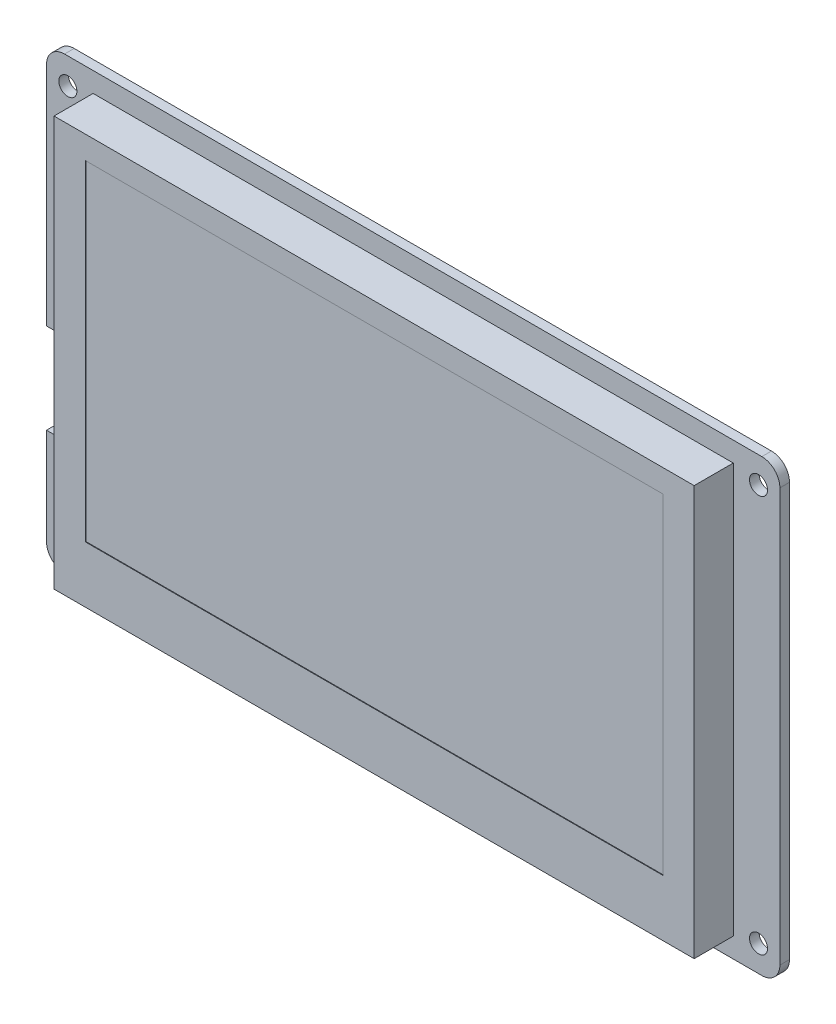
ISO-10303-21;
HEADER;
FILE_DESCRIPTION(('STEP AP214'),'2;1');
FILE_NAME('part.step','',(''),(''),'','','');
FILE_SCHEMA(('AUTOMOTIVE_DESIGN { 1 0 10303 214 1 1 1 1 }'));
ENDSEC;
DATA;
#1=APPLICATION_CONTEXT('core data for automotive mechanical design processes');
#2=APPLICATION_PROTOCOL_DEFINITION('international standard','automotive_design',2000,#1);
#3=PRODUCT_CONTEXT('',#1,'mechanical');
#4=PRODUCT('Part','Part','',(#3));
#5=PRODUCT_RELATED_PRODUCT_CATEGORY('part','',(#4));
#6=PRODUCT_DEFINITION_FORMATION('','',#4);
#7=PRODUCT_DEFINITION_CONTEXT('part definition',#1,'design');
#8=PRODUCT_DEFINITION('design','',#6,#7);
#9=PRODUCT_DEFINITION_SHAPE('','',#8);
#10=(LENGTH_UNIT() NAMED_UNIT(*) SI_UNIT(.MILLI.,.METRE.));
#11=(NAMED_UNIT(*) PLANE_ANGLE_UNIT() SI_UNIT($,.RADIAN.));
#12=(NAMED_UNIT(*) SI_UNIT($,.STERADIAN.) SOLID_ANGLE_UNIT());
#13=UNCERTAINTY_MEASURE_WITH_UNIT(LENGTH_MEASURE(1.E-05),#10,'distance_accuracy_value','');
#14=(GEOMETRIC_REPRESENTATION_CONTEXT(3) GLOBAL_UNCERTAINTY_ASSIGNED_CONTEXT((#13)) GLOBAL_UNIT_ASSIGNED_CONTEXT((#10,
#11,#12)) REPRESENTATION_CONTEXT('',''));
#15=CARTESIAN_POINT('',(0.,0.,0.));
#16=DIRECTION('',(0.,0.,1.));
#17=DIRECTION('',(1.,0.,0.));
#18=AXIS2_PLACEMENT_3D('',#15,#16,#17);
#19=CARTESIAN_POINT('',(0.,0.,0.));
#20=DIRECTION('',(0.,0.,-1.));
#21=DIRECTION('',(-1.,0.,0.));
#22=AXIS2_PLACEMENT_3D('',#19,#20,#21);
#23=PLANE('',#22);
#24=CARTESIAN_POINT('',(-57.4,33.,0.));
#25=DIRECTION('',(0.,0.,1.));
#26=DIRECTION('',(1.,0.,0.));
#27=AXIS2_PLACEMENT_3D('',#24,#25,#26);
#28=CIRCLE('',#27,1.5);
#29=CARTESIAN_POINT('',(-55.9,33.,0.));
#30=VERTEX_POINT('',#29);
#31=EDGE_CURVE('E296',#30,#30,#28,.T.);
#32=ORIENTED_EDGE('',*,*,#31,.T.);
#33=EDGE_LOOP('',(#32));
#34=FACE_BOUND('',#33,.T.);
#35=CARTESIAN_POINT('',(-57.4,-33.,0.));
#36=DIRECTION('',(0.,0.,1.));
#37=DIRECTION('',(1.,0.,0.));
#38=AXIS2_PLACEMENT_3D('',#35,#36,#37);
#39=CIRCLE('',#38,1.5);
#40=CARTESIAN_POINT('',(-55.9,-33.,0.));
#41=VERTEX_POINT('',#40);
#42=EDGE_CURVE('E290',#41,#41,#39,.T.);
#43=ORIENTED_EDGE('',*,*,#42,.T.);
#44=EDGE_LOOP('',(#43));
#45=FACE_BOUND('',#44,.T.);
#46=CARTESIAN_POINT('',(57.4,-33.,0.));
#47=DIRECTION('',(0.,0.,1.));
#48=DIRECTION('',(1.,0.,0.));
#49=AXIS2_PLACEMENT_3D('',#46,#47,#48);
#50=CIRCLE('',#49,1.5);
#51=CARTESIAN_POINT('',(58.9,-33.,0.));
#52=VERTEX_POINT('',#51);
#53=EDGE_CURVE('E284',#52,#52,#50,.T.);
#54=ORIENTED_EDGE('',*,*,#53,.T.);
#55=EDGE_LOOP('',(#54));
#56=FACE_BOUND('',#55,.T.);
#57=CARTESIAN_POINT('',(57.4,33.,0.));
#58=DIRECTION('',(0.,0.,1.));
#59=DIRECTION('',(1.,0.,0.));
#60=AXIS2_PLACEMENT_3D('',#57,#58,#59);
#61=CIRCLE('',#60,1.5);
#62=CARTESIAN_POINT('',(58.9,33.,0.));
#63=VERTEX_POINT('',#62);
#64=EDGE_CURVE('E278',#63,#63,#61,.T.);
#65=ORIENTED_EDGE('',*,*,#64,.T.);
#66=EDGE_LOOP('',(#65));
#67=FACE_BOUND('',#66,.T.);
#68=DIRECTION('',(-1.,0.,0.));
#69=VECTOR('',#68,1.);
#70=CARTESIAN_POINT('',(-56.75,-18.3,0.));
#71=LINE('',#70,#69);
#72=CARTESIAN_POINT('',(-56.75,-18.3,0.));
#73=VERTEX_POINT('',#72);
#74=CARTESIAN_POINT('',(-60.95,-18.3,0.));
#75=VERTEX_POINT('',#74);
#76=EDGE_CURVE('E187',#73,#75,#71,.T.);
#77=ORIENTED_EDGE('',*,*,#76,.F.);
#78=DIRECTION('',(0.,-1.,0.));
#79=VECTOR('',#78,1.);
#80=CARTESIAN_POINT('',(-56.75,-18.3,0.));
#81=LINE('',#80,#79);
#82=CARTESIAN_POINT('',(-56.75,-3.29999999999997,0.));
#83=VERTEX_POINT('',#82);
#84=EDGE_CURVE('E181',#83,#73,#81,.T.);
#85=ORIENTED_EDGE('',*,*,#84,.F.);
#86=DIRECTION('',(1.,0.,0.));
#87=VECTOR('',#86,1.);
#88=CARTESIAN_POINT('',(0.,-3.29999999999997,0.));
#89=LINE('',#88,#87);
#90=CARTESIAN_POINT('',(-60.95,-3.29999999999997,0.));
#91=VERTEX_POINT('',#90);
#92=EDGE_CURVE('E11',#91,#83,#89,.T.);
#93=ORIENTED_EDGE('',*,*,#92,.F.);
#94=DIRECTION('',(0.,-1.,0.));
#95=VECTOR('',#94,1.);
#96=CARTESIAN_POINT('',(-60.95,-37.35,0.));
#97=LINE('',#96,#95);
#98=CARTESIAN_POINT('',(-60.95,34.35,0.));
#99=VERTEX_POINT('',#98);
#100=EDGE_CURVE('E323',#99,#91,#97,.T.);
#101=ORIENTED_EDGE('',*,*,#100,.F.);
#102=CARTESIAN_POINT('',(-57.95,34.35,0.));
#103=DIRECTION('',(0.,0.,-1.));
#104=DIRECTION('',(-1.,0.,0.));
#105=AXIS2_PLACEMENT_3D('',#102,#103,#104);
#106=CIRCLE('',#105,3.);
#107=CARTESIAN_POINT('',(-57.95,37.35,0.));
#108=VERTEX_POINT('',#107);
#109=EDGE_CURVE('E339',#99,#108,#106,.T.);
#110=ORIENTED_EDGE('',*,*,#109,.T.);
#111=DIRECTION('',(-1.,0.,0.));
#112=VECTOR('',#111,1.);
#113=CARTESIAN_POINT('',(-60.95,37.35,0.));
#114=LINE('',#113,#112);
#115=CARTESIAN_POINT('',(57.95,37.35,0.));
#116=VERTEX_POINT('',#115);
#117=EDGE_CURVE('E319',#116,#108,#114,.T.);
#118=ORIENTED_EDGE('',*,*,#117,.F.);
#119=CARTESIAN_POINT('',(57.95,34.35,0.));
#120=DIRECTION('',(0.,0.,-1.));
#121=DIRECTION('',(-1.,0.,0.));
#122=AXIS2_PLACEMENT_3D('',#119,#120,#121);
#123=CIRCLE('',#122,3.);
#124=CARTESIAN_POINT('',(60.95,34.35,0.));
#125=VERTEX_POINT('',#124);
#126=EDGE_CURVE('E332',#116,#125,#123,.T.);
#127=ORIENTED_EDGE('',*,*,#126,.T.);
#128=DIRECTION('',(0.,1.,0.));
#129=VECTOR('',#128,1.);
#130=CARTESIAN_POINT('',(60.95,-37.35,0.));
#131=LINE('',#130,#129);
#132=CARTESIAN_POINT('',(60.95,-34.35,0.));
#133=VERTEX_POINT('',#132);
#134=EDGE_CURVE('E299',#133,#125,#131,.T.);
#135=ORIENTED_EDGE('',*,*,#134,.F.);
#136=CARTESIAN_POINT('',(57.95,-34.35,0.));
#137=DIRECTION('',(0.,0.,-1.));
#138=DIRECTION('',(-1.,0.,0.));
#139=AXIS2_PLACEMENT_3D('',#136,#137,#138);
#140=CIRCLE('',#139,3.);
#141=CARTESIAN_POINT('',(57.95,-37.35,0.));
#142=VERTEX_POINT('',#141);
#143=EDGE_CURVE('E334',#133,#142,#140,.T.);
#144=ORIENTED_EDGE('',*,*,#143,.T.);
#145=DIRECTION('',(1.,0.,0.));
#146=VECTOR('',#145,1.);
#147=CARTESIAN_POINT('',(-60.95,-37.35,0.));
#148=LINE('',#147,#146);
#149=CARTESIAN_POINT('',(-57.95,-37.35,0.));
#150=VERTEX_POINT('',#149);
#151=EDGE_CURVE('E306',#150,#142,#148,.T.);
#152=ORIENTED_EDGE('',*,*,#151,.F.);
#153=CARTESIAN_POINT('',(-57.95,-34.35,0.));
#154=DIRECTION('',(0.,0.,-1.));
#155=DIRECTION('',(-1.,0.,0.));
#156=AXIS2_PLACEMENT_3D('',#153,#154,#155);
#157=CIRCLE('',#156,3.);
#158=CARTESIAN_POINT('',(-60.95,-34.35,0.));
#159=VERTEX_POINT('',#158);
#160=EDGE_CURVE('E336',#150,#159,#157,.T.);
#161=ORIENTED_EDGE('',*,*,#160,.T.);
#162=EDGE_CURVE('E322',#75,#159,#97,.T.);
#163=ORIENTED_EDGE('',*,*,#162,.F.);
#164=EDGE_LOOP('',(#77,#85,#93,#101,#110,#118,#127,#135,#144,#152,#161,#163));
#165=FACE_BOUND('',#164,.T.);
#166=CARTESIAN_POINT('',(-40.95,25.35,1.11022302462516E-13));
#167=DIRECTION('',(0.,0.,-1.));
#168=DIRECTION('',(-1.,0.,0.));
#169=AXIS2_PLACEMENT_3D('',#166,#167,#168);
#170=CIRCLE('',#169,5.);
#171=CARTESIAN_POINT('',(-45.95,25.35,1.11022302462516E-13));
#172=VERTEX_POINT('',#171);
#173=EDGE_CURVE('E199',#172,#172,#170,.T.);
#174=ORIENTED_EDGE('',*,*,#173,.F.);
#175=EDGE_LOOP('',(#174));
#176=FACE_BOUND('',#175,.T.);
#177=ADVANCED_FACE('F40',(#34,#45,#56,#67,#165,#176),#23,.T.);
#178=CARTESIAN_POINT('',(-60.95,-37.3500000000001,1.60000000000005));
#179=DIRECTION('',(1.,0.,0.));
#180=DIRECTION('',(0.,0.,-1.));
#181=AXIS2_PLACEMENT_3D('',#178,#179,#180);
#182=PLANE('',#181);
#183=DIRECTION('',(0.,-1.,0.));
#184=VECTOR('',#183,1.);
#185=CARTESIAN_POINT('',(-60.95,-37.3500000000001,1.60000000000005));
#186=LINE('',#185,#184);
#187=CARTESIAN_POINT('',(-60.95,-18.3,1.60000000000005));
#188=VERTEX_POINT('',#187);
#189=CARTESIAN_POINT('',(-60.95,-34.35,1.60000000000005));
#190=VERTEX_POINT('',#189);
#191=EDGE_CURVE('E309',#188,#190,#186,.T.);
#192=ORIENTED_EDGE('',*,*,#191,.F.);
#193=DIRECTION('',(0.,0.,-1.));
#194=VECTOR('',#193,1.);
#195=CARTESIAN_POINT('',(-60.95,-18.3,1.60000000000005));
#196=LINE('',#195,#194);
#197=EDGE_CURVE('E208',#188,#75,#196,.T.);
#198=ORIENTED_EDGE('',*,*,#197,.T.);
#199=ORIENTED_EDGE('',*,*,#162,.T.);
#200=DIRECTION('',(0.,0.,-1.));
#201=VECTOR('',#200,1.);
#202=CARTESIAN_POINT('',(-60.95,-34.35,1.60000000000005));
#203=LINE('',#202,#201);
#204=EDGE_CURVE('E316',#159,#190,#203,.F.);
#205=ORIENTED_EDGE('',*,*,#204,.T.);
#206=EDGE_LOOP('',(#192,#198,#199,#205));
#207=FACE_BOUND('',#206,.T.);
#208=ADVANCED_FACE('F391',(#207),#182,.F.);
#209=CARTESIAN_POINT('',(0.,0.,1.60000000000005));
#210=DIRECTION('',(0.,0.,-1.));
#211=DIRECTION('',(-1.,0.,0.));
#212=AXIS2_PLACEMENT_3D('',#209,#210,#211);
#213=PLANE('',#212);
#214=DIRECTION('',(0.,-1.,0.));
#215=VECTOR('',#214,1.);
#216=CARTESIAN_POINT('',(-56.75,0.,1.60000000000005));
#217=LINE('',#216,#215);
#218=CARTESIAN_POINT('',(-56.75,-3.29999999999997,1.60000000000005));
#219=VERTEX_POINT('',#218);
#220=CARTESIAN_POINT('',(-56.75,-18.3,1.60000000000005));
#221=VERTEX_POINT('',#220);
#222=EDGE_CURVE('E184',#219,#221,#217,.T.);
#223=ORIENTED_EDGE('',*,*,#222,.T.);
#224=DIRECTION('',(-1.,0.,0.));
#225=VECTOR('',#224,1.);
#226=CARTESIAN_POINT('',(0.,-18.3,1.60000000000005));
#227=LINE('',#226,#225);
#228=EDGE_CURVE('E211',#221,#188,#227,.T.);
#229=ORIENTED_EDGE('',*,*,#228,.T.);
#230=ORIENTED_EDGE('',*,*,#191,.T.);
#231=CARTESIAN_POINT('',(-57.95,-34.35,1.60000000000005));
#232=DIRECTION('',(0.,0.,-1.));
#233=DIRECTION('',(-1.,0.,0.));
#234=AXIS2_PLACEMENT_3D('',#231,#232,#233);
#235=CIRCLE('',#234,3.);
#236=CARTESIAN_POINT('',(-57.95,-37.3500000000001,1.60000000000005));
#237=VERTEX_POINT('',#236);
#238=EDGE_CURVE('E350',#190,#237,#235,.F.);
#239=ORIENTED_EDGE('',*,*,#238,.T.);
#240=DIRECTION('',(1.,0.,0.));
#241=VECTOR('',#240,1.);
#242=CARTESIAN_POINT('',(-60.95,-37.3500000000001,1.60000000000005));
#243=LINE('',#242,#241);
#244=CARTESIAN_POINT('',(57.95,-37.3500000000001,1.60000000000005));
#245=VERTEX_POINT('',#244);
#246=EDGE_CURVE('E313',#237,#245,#243,.T.);
#247=ORIENTED_EDGE('',*,*,#246,.T.);
#248=CARTESIAN_POINT('',(57.95,-34.35,1.60000000000005));
#249=DIRECTION('',(0.,0.,-1.));
#250=DIRECTION('',(-1.,0.,0.));
#251=AXIS2_PLACEMENT_3D('',#248,#249,#250);
#252=CIRCLE('',#251,3.);
#253=CARTESIAN_POINT('',(60.95,-34.35,1.60000000000005));
#254=VERTEX_POINT('',#253);
#255=EDGE_CURVE('E348',#245,#254,#252,.F.);
#256=ORIENTED_EDGE('',*,*,#255,.T.);
#257=DIRECTION('',(0.,1.,0.));
#258=VECTOR('',#257,1.);
#259=CARTESIAN_POINT('',(60.95,-37.3500000000001,1.60000000000005));
#260=LINE('',#259,#258);
#261=CARTESIAN_POINT('',(60.95,34.35,1.60000000000005));
#262=VERTEX_POINT('',#261);
#263=EDGE_CURVE('E302',#254,#262,#260,.T.);
#264=ORIENTED_EDGE('',*,*,#263,.T.);
#265=CARTESIAN_POINT('',(57.95,34.35,1.60000000000005));
#266=DIRECTION('',(0.,0.,-1.));
#267=DIRECTION('',(-1.,0.,0.));
#268=AXIS2_PLACEMENT_3D('',#265,#266,#267);
#269=CIRCLE('',#268,3.);
#270=CARTESIAN_POINT('',(57.95,37.35,1.60000000000005));
#271=VERTEX_POINT('',#270);
#272=EDGE_CURVE('E346',#262,#271,#269,.F.);
#273=ORIENTED_EDGE('',*,*,#272,.T.);
#274=DIRECTION('',(-1.,0.,0.));
#275=VECTOR('',#274,1.);
#276=CARTESIAN_POINT('',(-60.95,37.35,1.60000000000005));
#277=LINE('',#276,#275);
#278=CARTESIAN_POINT('',(-57.95,37.35,1.60000000000005));
#279=VERTEX_POINT('',#278);
#280=EDGE_CURVE('E305',#271,#279,#277,.T.);
#281=ORIENTED_EDGE('',*,*,#280,.T.);
#282=CARTESIAN_POINT('',(-57.95,34.35,1.60000000000005));
#283=DIRECTION('',(0.,0.,-1.));
#284=DIRECTION('',(-1.,0.,0.));
#285=AXIS2_PLACEMENT_3D('',#282,#283,#284);
#286=CIRCLE('',#285,3.);
#287=CARTESIAN_POINT('',(-60.95,34.35,1.60000000000005));
#288=VERTEX_POINT('',#287);
#289=EDGE_CURVE('E352',#279,#288,#286,.F.);
#290=ORIENTED_EDGE('',*,*,#289,.T.);
#291=CARTESIAN_POINT('',(-60.95,-3.29999999999997,1.60000000000005));
#292=VERTEX_POINT('',#291);
#293=EDGE_CURVE('E310',#288,#292,#186,.T.);
#294=ORIENTED_EDGE('',*,*,#293,.T.);
#295=DIRECTION('',(1.,0.,0.));
#296=VECTOR('',#295,1.);
#297=CARTESIAN_POINT('',(0.,-3.29999999999997,1.60000000000005));
#298=LINE('',#297,#296);
#299=EDGE_CURVE('E205',#292,#219,#298,.T.);
#300=ORIENTED_EDGE('',*,*,#299,.T.);
#301=EDGE_LOOP('',(#223,#229,#230,#239,#247,#256,#264,#273,#281,#290,#294,#300));
#302=FACE_BOUND('',#301,.T.);
#303=CARTESIAN_POINT('',(-57.4,33.,1.60000000000005));
#304=DIRECTION('',(0.,0.,1.));
#305=DIRECTION('',(1.,0.,0.));
#306=AXIS2_PLACEMENT_3D('',#303,#304,#305);
#307=CIRCLE('',#306,1.5);
#308=CARTESIAN_POINT('',(-55.9,33.,1.60000000000005));
#309=VERTEX_POINT('',#308);
#310=EDGE_CURVE('E293',#309,#309,#307,.T.);
#311=ORIENTED_EDGE('',*,*,#310,.F.);
#312=EDGE_LOOP('',(#311));
#313=FACE_BOUND('',#312,.T.);
#314=CARTESIAN_POINT('',(-57.4,-33.,1.6000000000001));
#315=DIRECTION('',(0.,0.,1.));
#316=DIRECTION('',(1.,0.,0.));
#317=AXIS2_PLACEMENT_3D('',#314,#315,#316);
#318=CIRCLE('',#317,1.5);
#319=CARTESIAN_POINT('',(-55.9,-33.,1.6000000000001));
#320=VERTEX_POINT('',#319);
#321=EDGE_CURVE('E287',#320,#320,#318,.T.);
#322=ORIENTED_EDGE('',*,*,#321,.F.);
#323=EDGE_LOOP('',(#322));
#324=FACE_BOUND('',#323,.T.);
#325=CARTESIAN_POINT('',(57.4,-33.,1.6000000000001));
#326=DIRECTION('',(0.,0.,1.));
#327=DIRECTION('',(1.,0.,0.));
#328=AXIS2_PLACEMENT_3D('',#325,#326,#327);
#329=CIRCLE('',#328,1.5);
#330=CARTESIAN_POINT('',(58.9,-33.,1.6000000000001));
#331=VERTEX_POINT('',#330);
#332=EDGE_CURVE('E281',#331,#331,#329,.T.);
#333=ORIENTED_EDGE('',*,*,#332,.F.);
#334=EDGE_LOOP('',(#333));
#335=FACE_BOUND('',#334,.T.);
#336=CARTESIAN_POINT('',(57.4,33.,1.60000000000005));
#337=DIRECTION('',(0.,0.,1.));
#338=DIRECTION('',(1.,0.,0.));
#339=AXIS2_PLACEMENT_3D('',#336,#337,#338);
#340=CIRCLE('',#339,1.5);
#341=CARTESIAN_POINT('',(58.9,33.,1.60000000000005));
#342=VERTEX_POINT('',#341);
#343=EDGE_CURVE('E277',#342,#342,#340,.T.);
#344=ORIENTED_EDGE('',*,*,#343,.F.);
#345=EDGE_LOOP('',(#344));
#346=FACE_BOUND('',#345,.T.);
#347=DIRECTION('',(0.,1.,0.));
#348=VECTOR('',#347,1.);
#349=CARTESIAN_POINT('',(53.2,-34.05,1.59999999999999));
#350=LINE('',#349,#348);
#351=CARTESIAN_POINT('',(53.2,-34.05,1.59999999999999));
#352=VERTEX_POINT('',#351);
#353=CARTESIAN_POINT('',(53.2,34.05,1.60000000000005));
#354=VERTEX_POINT('',#353);
#355=EDGE_CURVE('E239',#352,#354,#350,.T.);
#356=ORIENTED_EDGE('',*,*,#355,.F.);
#357=DIRECTION('',(1.,0.,0.));
#358=VECTOR('',#357,1.);
#359=CARTESIAN_POINT('',(-53.2,-34.05,1.59999999999999));
#360=LINE('',#359,#358);
#361=CARTESIAN_POINT('',(-53.2,-34.05,1.59999999999999));
#362=VERTEX_POINT('',#361);
#363=EDGE_CURVE('E249',#362,#352,#360,.T.);
#364=ORIENTED_EDGE('',*,*,#363,.F.);
#365=DIRECTION('',(0.,-1.,0.));
#366=VECTOR('',#365,1.);
#367=CARTESIAN_POINT('',(-53.2,-34.05,1.59999999999999));
#368=LINE('',#367,#366);
#369=CARTESIAN_POINT('',(-53.2,34.05,1.60000000000005));
#370=VERTEX_POINT('',#369);
#371=EDGE_CURVE('E261',#370,#362,#368,.T.);
#372=ORIENTED_EDGE('',*,*,#371,.F.);
#373=DIRECTION('',(-1.,0.,0.));
#374=VECTOR('',#373,1.);
#375=CARTESIAN_POINT('',(-53.2,34.05,1.60000000000005));
#376=LINE('',#375,#374);
#377=EDGE_CURVE('E258',#354,#370,#376,.T.);
#378=ORIENTED_EDGE('',*,*,#377,.F.);
#379=EDGE_LOOP('',(#356,#364,#372,#378));
#380=FACE_BOUND('',#379,.T.);
#381=ADVANCED_FACE('F380',(#302,#313,#324,#335,#346,#380),#213,.F.);
#382=CARTESIAN_POINT('',(60.95,-37.3500000000001,1.60000000000005));
#383=DIRECTION('',(-1.,0.,0.));
#384=DIRECTION('',(0.,0.,1.));
#385=AXIS2_PLACEMENT_3D('',#382,#383,#384);
#386=PLANE('',#385);
#387=ORIENTED_EDGE('',*,*,#263,.F.);
#388=DIRECTION('',(0.,0.,-1.));
#389=VECTOR('',#388,1.);
#390=CARTESIAN_POINT('',(60.95,-34.35,1.60000000000005));
#391=LINE('',#390,#389);
#392=EDGE_CURVE('E48',#254,#133,#391,.T.);
#393=ORIENTED_EDGE('',*,*,#392,.T.);
#394=ORIENTED_EDGE('',*,*,#134,.T.);
#395=DIRECTION('',(0.,0.,-1.));
#396=VECTOR('',#395,1.);
#397=CARTESIAN_POINT('',(60.95,34.35,1.60000000000005));
#398=LINE('',#397,#396);
#399=EDGE_CURVE('E359',#125,#262,#398,.F.);
#400=ORIENTED_EDGE('',*,*,#399,.T.);
#401=EDGE_LOOP('',(#387,#393,#394,#400));
#402=FACE_BOUND('',#401,.T.);
#403=ADVANCED_FACE('F365',(#402),#386,.F.);
#404=CARTESIAN_POINT('',(-60.95,37.35,1.60000000000005));
#405=DIRECTION('',(0.,-1.,0.));
#406=DIRECTION('',(0.,0.,-1.));
#407=AXIS2_PLACEMENT_3D('',#404,#405,#406);
#408=PLANE('',#407);
#409=ORIENTED_EDGE('',*,*,#117,.T.);
#410=DIRECTION('',(0.,0.,-1.));
#411=VECTOR('',#410,1.);
#412=CARTESIAN_POINT('',(-57.95,37.35,1.60000000000005));
#413=LINE('',#412,#411);
#414=EDGE_CURVE('E344',#108,#279,#413,.F.);
#415=ORIENTED_EDGE('',*,*,#414,.T.);
#416=ORIENTED_EDGE('',*,*,#280,.F.);
#417=DIRECTION('',(0.,0.,-1.));
#418=VECTOR('',#417,1.);
#419=CARTESIAN_POINT('',(57.95,37.35,1.60000000000005));
#420=LINE('',#419,#418);
#421=EDGE_CURVE('E341',#271,#116,#420,.T.);
#422=ORIENTED_EDGE('',*,*,#421,.T.);
#423=EDGE_LOOP('',(#409,#415,#416,#422));
#424=FACE_BOUND('',#423,.T.);
#425=ADVANCED_FACE('F376',(#424),#408,.F.);
#426=ORIENTED_EDGE('',*,*,#100,.T.);
#427=DIRECTION('',(0.,0.,1.));
#428=VECTOR('',#427,1.);
#429=CARTESIAN_POINT('',(-60.95,-3.29999999999997,1.60000000000005));
#430=LINE('',#429,#428);
#431=EDGE_CURVE('E54',#91,#292,#430,.T.);
#432=ORIENTED_EDGE('',*,*,#431,.T.);
#433=ORIENTED_EDGE('',*,*,#293,.F.);
#434=DIRECTION('',(0.,0.,-1.));
#435=VECTOR('',#434,1.);
#436=CARTESIAN_POINT('',(-60.95,34.35,1.60000000000005));
#437=LINE('',#436,#435);
#438=EDGE_CURVE('E329',#288,#99,#437,.T.);
#439=ORIENTED_EDGE('',*,*,#438,.T.);
#440=EDGE_LOOP('',(#426,#432,#433,#439));
#441=FACE_BOUND('',#440,.T.);
#442=ADVANCED_FACE('F387',(#441),#182,.F.);
#443=CARTESIAN_POINT('',(-60.95,-37.3500000000001,1.60000000000005));
#444=DIRECTION('',(0.,1.,0.));
#445=DIRECTION('',(0.,0.,1.));
#446=AXIS2_PLACEMENT_3D('',#443,#444,#445);
#447=PLANE('',#446);
#448=ORIENTED_EDGE('',*,*,#246,.F.);
#449=DIRECTION('',(0.,0.,-1.));
#450=VECTOR('',#449,1.);
#451=CARTESIAN_POINT('',(-57.95,-37.3500000000001,1.60000000000005));
#452=LINE('',#451,#450);
#453=EDGE_CURVE('E356',#237,#150,#452,.T.);
#454=ORIENTED_EDGE('',*,*,#453,.T.);
#455=ORIENTED_EDGE('',*,*,#151,.T.);
#456=DIRECTION('',(0.,0.,-1.));
#457=VECTOR('',#456,1.);
#458=CARTESIAN_POINT('',(57.95,-37.3500000000001,1.60000000000005));
#459=LINE('',#458,#457);
#460=EDGE_CURVE('E354',#142,#245,#459,.F.);
#461=ORIENTED_EDGE('',*,*,#460,.T.);
#462=EDGE_LOOP('',(#448,#454,#455,#461));
#463=FACE_BOUND('',#462,.T.);
#464=ADVANCED_FACE('F399',(#463),#447,.F.);
#465=CARTESIAN_POINT('',(-57.4,33.,0.));
#466=DIRECTION('',(0.,0.,1.));
#467=DIRECTION('',(1.,0.,0.));
#468=AXIS2_PLACEMENT_3D('',#465,#466,#467);
#469=CYLINDRICAL_SURFACE('',#468,1.5);
#470=ORIENTED_EDGE('',*,*,#31,.F.);
#471=EDGE_LOOP('',(#470));
#472=FACE_BOUND('',#471,.T.);
#473=ORIENTED_EDGE('',*,*,#310,.T.);
#474=EDGE_LOOP('',(#473));
#475=FACE_BOUND('',#474,.T.);
#476=ADVANCED_FACE('F421',(#472,#475),#469,.F.);
#477=CARTESIAN_POINT('',(-57.4,-33.,0.));
#478=DIRECTION('',(0.,0.,1.));
#479=DIRECTION('',(1.,0.,0.));
#480=AXIS2_PLACEMENT_3D('',#477,#478,#479);
#481=CYLINDRICAL_SURFACE('',#480,1.5);
#482=ORIENTED_EDGE('',*,*,#42,.F.);
#483=EDGE_LOOP('',(#482));
#484=FACE_BOUND('',#483,.T.);
#485=ORIENTED_EDGE('',*,*,#321,.T.);
#486=EDGE_LOOP('',(#485));
#487=FACE_BOUND('',#486,.T.);
#488=ADVANCED_FACE('F439',(#484,#487),#481,.F.);
#489=CARTESIAN_POINT('',(57.4,-33.,0.));
#490=DIRECTION('',(0.,0.,1.));
#491=DIRECTION('',(1.,0.,0.));
#492=AXIS2_PLACEMENT_3D('',#489,#490,#491);
#493=CYLINDRICAL_SURFACE('',#492,1.5);
#494=ORIENTED_EDGE('',*,*,#53,.F.);
#495=EDGE_LOOP('',(#494));
#496=FACE_BOUND('',#495,.T.);
#497=ORIENTED_EDGE('',*,*,#332,.T.);
#498=EDGE_LOOP('',(#497));
#499=FACE_BOUND('',#498,.T.);
#500=ADVANCED_FACE('F433',(#496,#499),#493,.F.);
#501=CARTESIAN_POINT('',(57.4,33.,0.));
#502=DIRECTION('',(0.,0.,1.));
#503=DIRECTION('',(1.,0.,0.));
#504=AXIS2_PLACEMENT_3D('',#501,#502,#503);
#505=CYLINDRICAL_SURFACE('',#504,1.5);
#506=ORIENTED_EDGE('',*,*,#64,.F.);
#507=EDGE_LOOP('',(#506));
#508=FACE_BOUND('',#507,.T.);
#509=ORIENTED_EDGE('',*,*,#343,.T.);
#510=EDGE_LOOP('',(#509));
#511=FACE_BOUND('',#510,.T.);
#512=ADVANCED_FACE('F429',(#508,#511),#505,.F.);
#513=CARTESIAN_POINT('',(-57.95,34.35,1.60000000000005));
#514=DIRECTION('',(0.,0.,-1.));
#515=DIRECTION('',(-1.,0.,0.));
#516=AXIS2_PLACEMENT_3D('',#513,#514,#515);
#517=CYLINDRICAL_SURFACE('',#516,3.);
#518=ORIENTED_EDGE('',*,*,#289,.F.);
#519=ORIENTED_EDGE('',*,*,#414,.F.);
#520=ORIENTED_EDGE('',*,*,#109,.F.);
#521=ORIENTED_EDGE('',*,*,#438,.F.);
#522=EDGE_LOOP('',(#518,#519,#520,#521));
#523=FACE_BOUND('',#522,.T.);
#524=ADVANCED_FACE('F385',(#523),#517,.T.);
#525=CARTESIAN_POINT('',(-57.95,-34.35,1.60000000000005));
#526=DIRECTION('',(0.,0.,-1.));
#527=DIRECTION('',(-1.,0.,0.));
#528=AXIS2_PLACEMENT_3D('',#525,#526,#527);
#529=CYLINDRICAL_SURFACE('',#528,3.);
#530=ORIENTED_EDGE('',*,*,#238,.F.);
#531=ORIENTED_EDGE('',*,*,#204,.F.);
#532=ORIENTED_EDGE('',*,*,#160,.F.);
#533=ORIENTED_EDGE('',*,*,#453,.F.);
#534=EDGE_LOOP('',(#530,#531,#532,#533));
#535=FACE_BOUND('',#534,.T.);
#536=ADVANCED_FACE('F396',(#535),#529,.T.);
#537=CARTESIAN_POINT('',(57.95,-34.35,1.60000000000005));
#538=DIRECTION('',(0.,0.,-1.));
#539=DIRECTION('',(-1.,0.,0.));
#540=AXIS2_PLACEMENT_3D('',#537,#538,#539);
#541=CYLINDRICAL_SURFACE('',#540,3.);
#542=ORIENTED_EDGE('',*,*,#255,.F.);
#543=ORIENTED_EDGE('',*,*,#460,.F.);
#544=ORIENTED_EDGE('',*,*,#143,.F.);
#545=ORIENTED_EDGE('',*,*,#392,.F.);
#546=EDGE_LOOP('',(#542,#543,#544,#545));
#547=FACE_BOUND('',#546,.T.);
#548=ADVANCED_FACE('F401',(#547),#541,.T.);
#549=CARTESIAN_POINT('',(57.95,34.35,1.60000000000005));
#550=DIRECTION('',(0.,0.,-1.));
#551=DIRECTION('',(-1.,0.,0.));
#552=AXIS2_PLACEMENT_3D('',#549,#550,#551);
#553=CYLINDRICAL_SURFACE('',#552,3.);
#554=ORIENTED_EDGE('',*,*,#272,.F.);
#555=ORIENTED_EDGE('',*,*,#399,.F.);
#556=ORIENTED_EDGE('',*,*,#126,.F.);
#557=ORIENTED_EDGE('',*,*,#421,.F.);
#558=EDGE_LOOP('',(#554,#555,#556,#557));
#559=FACE_BOUND('',#558,.T.);
#560=ADVANCED_FACE('F42',(#559),#553,.T.);
#561=CARTESIAN_POINT('',(53.2,-34.05,8.10000000000005));
#562=DIRECTION('',(-1.,0.,0.));
#563=DIRECTION('',(0.,0.,1.));
#564=AXIS2_PLACEMENT_3D('',#561,#562,#563);
#565=PLANE('',#564);
#566=ORIENTED_EDGE('',*,*,#355,.T.);
#567=DIRECTION('',(0.,0.,-1.));
#568=VECTOR('',#567,1.);
#569=CARTESIAN_POINT('',(53.2,34.05,8.10000000000011));
#570=LINE('',#569,#568);
#571=CARTESIAN_POINT('',(53.2,34.05,8.10000000000011));
#572=VERTEX_POINT('',#571);
#573=EDGE_CURVE('E274',#572,#354,#570,.T.);
#574=ORIENTED_EDGE('',*,*,#573,.F.);
#575=DIRECTION('',(0.,1.,0.));
#576=VECTOR('',#575,1.);
#577=CARTESIAN_POINT('',(53.2,-34.05,8.10000000000005));
#578=LINE('',#577,#576);
#579=CARTESIAN_POINT('',(53.2,-34.05,8.10000000000005));
#580=VERTEX_POINT('',#579);
#581=EDGE_CURVE('E245',#580,#572,#578,.T.);
#582=ORIENTED_EDGE('',*,*,#581,.F.);
#583=DIRECTION('',(0.,0.,-1.));
#584=VECTOR('',#583,1.);
#585=CARTESIAN_POINT('',(53.2,-34.05,8.10000000000005));
#586=LINE('',#585,#584);
#587=EDGE_CURVE('E255',#580,#352,#586,.T.);
#588=ORIENTED_EDGE('',*,*,#587,.T.);
#589=EDGE_LOOP('',(#566,#574,#582,#588));
#590=FACE_BOUND('',#589,.T.);
#591=ADVANCED_FACE('F407',(#590),#565,.F.);
#592=CARTESIAN_POINT('',(-53.2,34.05,8.10000000000011));
#593=DIRECTION('',(0.,-1.,0.));
#594=DIRECTION('',(0.,0.,-1.));
#595=AXIS2_PLACEMENT_3D('',#592,#593,#594);
#596=PLANE('',#595);
#597=ORIENTED_EDGE('',*,*,#377,.T.);
#598=DIRECTION('',(0.,0.,-1.));
#599=VECTOR('',#598,1.);
#600=CARTESIAN_POINT('',(-53.2,34.05,8.10000000000011));
#601=LINE('',#600,#599);
#602=CARTESIAN_POINT('',(-53.2,34.05,8.10000000000011));
#603=VERTEX_POINT('',#602);
#604=EDGE_CURVE('E271',#603,#370,#601,.T.);
#605=ORIENTED_EDGE('',*,*,#604,.F.);
#606=DIRECTION('',(-1.,0.,0.));
#607=VECTOR('',#606,1.);
#608=CARTESIAN_POINT('',(-53.2,34.05,8.10000000000011));
#609=LINE('',#608,#607);
#610=EDGE_CURVE('E248',#572,#603,#609,.T.);
#611=ORIENTED_EDGE('',*,*,#610,.F.);
#612=ORIENTED_EDGE('',*,*,#573,.T.);
#613=EDGE_LOOP('',(#597,#605,#611,#612));
#614=FACE_BOUND('',#613,.T.);
#615=ADVANCED_FACE('F479',(#614),#596,.F.);
#616=CARTESIAN_POINT('',(-53.2,-34.05,8.10000000000005));
#617=DIRECTION('',(1.,0.,0.));
#618=DIRECTION('',(0.,0.,-1.));
#619=AXIS2_PLACEMENT_3D('',#616,#617,#618);
#620=PLANE('',#619);
#621=ORIENTED_EDGE('',*,*,#371,.T.);
#622=DIRECTION('',(0.,0.,-1.));
#623=VECTOR('',#622,1.);
#624=CARTESIAN_POINT('',(-53.2,-34.05,8.10000000000005));
#625=LINE('',#624,#623);
#626=CARTESIAN_POINT('',(-53.2,-34.05,8.10000000000005));
#627=VERTEX_POINT('',#626);
#628=EDGE_CURVE('E268',#627,#362,#625,.T.);
#629=ORIENTED_EDGE('',*,*,#628,.F.);
#630=DIRECTION('',(0.,-1.,0.));
#631=VECTOR('',#630,1.);
#632=CARTESIAN_POINT('',(-53.2,-34.05,8.10000000000005));
#633=LINE('',#632,#631);
#634=EDGE_CURVE('E251',#603,#627,#633,.T.);
#635=ORIENTED_EDGE('',*,*,#634,.F.);
#636=ORIENTED_EDGE('',*,*,#604,.T.);
#637=EDGE_LOOP('',(#621,#629,#635,#636));
#638=FACE_BOUND('',#637,.T.);
#639=ADVANCED_FACE('F477',(#638),#620,.F.);
#640=CARTESIAN_POINT('',(-53.2,-34.05,8.10000000000005));
#641=DIRECTION('',(0.,1.,0.));
#642=DIRECTION('',(0.,0.,1.));
#643=AXIS2_PLACEMENT_3D('',#640,#641,#642);
#644=PLANE('',#643);
#645=ORIENTED_EDGE('',*,*,#363,.T.);
#646=ORIENTED_EDGE('',*,*,#587,.F.);
#647=DIRECTION('',(1.,0.,0.));
#648=VECTOR('',#647,1.);
#649=CARTESIAN_POINT('',(-53.2,-34.05,8.10000000000005));
#650=LINE('',#649,#648);
#651=EDGE_CURVE('E253',#627,#580,#650,.T.);
#652=ORIENTED_EDGE('',*,*,#651,.F.);
#653=ORIENTED_EDGE('',*,*,#628,.T.);
#654=EDGE_LOOP('',(#645,#646,#652,#653));
#655=FACE_BOUND('',#654,.T.);
#656=ADVANCED_FACE('F468',(#655),#644,.F.);
#657=CARTESIAN_POINT('',(0.,0.,8.10000000000005));
#658=DIRECTION('',(0.,0.,-1.));
#659=DIRECTION('',(-1.,0.,0.));
#660=AXIS2_PLACEMENT_3D('',#657,#658,#659);
#661=PLANE('',#660);
#662=DIRECTION('',(-1.,0.,0.));
#663=VECTOR('',#662,1.);
#664=CARTESIAN_POINT('',(-48.,30.25,8.10000000000005));
#665=LINE('',#664,#663);
#666=CARTESIAN_POINT('',(48.,30.25,8.10000000000005));
#667=VERTEX_POINT('',#666);
#668=CARTESIAN_POINT('',(-48.,30.25,8.10000000000005));
#669=VERTEX_POINT('',#668);
#670=EDGE_CURVE('E229',#667,#669,#665,.T.);
#671=ORIENTED_EDGE('',*,*,#670,.F.);
#672=DIRECTION('',(0.,1.,0.));
#673=VECTOR('',#672,1.);
#674=CARTESIAN_POINT('',(48.,-24.65,8.10000000000005));
#675=LINE('',#674,#673);
#676=CARTESIAN_POINT('',(48.,-24.65,8.10000000000005));
#677=VERTEX_POINT('',#676);
#678=EDGE_CURVE('E62',#677,#667,#675,.T.);
#679=ORIENTED_EDGE('',*,*,#678,.F.);
#680=DIRECTION('',(1.,0.,0.));
#681=VECTOR('',#680,1.);
#682=CARTESIAN_POINT('',(-48.,-24.65,8.10000000000005));
#683=LINE('',#682,#681);
#684=CARTESIAN_POINT('',(-48.,-24.65,8.10000000000005));
#685=VERTEX_POINT('',#684);
#686=EDGE_CURVE('E218',#685,#677,#683,.T.);
#687=ORIENTED_EDGE('',*,*,#686,.F.);
#688=DIRECTION('',(0.,-1.,0.));
#689=VECTOR('',#688,1.);
#690=CARTESIAN_POINT('',(-48.,-24.65,8.10000000000005));
#691=LINE('',#690,#689);
#692=EDGE_CURVE('E232',#669,#685,#691,.T.);
#693=ORIENTED_EDGE('',*,*,#692,.F.);
#694=EDGE_LOOP('',(#671,#679,#687,#693));
#695=FACE_BOUND('',#694,.T.);
#696=ORIENTED_EDGE('',*,*,#581,.T.);
#697=ORIENTED_EDGE('',*,*,#610,.T.);
#698=ORIENTED_EDGE('',*,*,#634,.T.);
#699=ORIENTED_EDGE('',*,*,#651,.T.);
#700=EDGE_LOOP('',(#696,#697,#698,#699));
#701=FACE_BOUND('',#700,.T.);
#702=ADVANCED_FACE('F473',(#695,#701),#661,.F.);
#703=CARTESIAN_POINT('',(48.,-24.6499999999999,8.00000000000001));
#704=DIRECTION('',(1.,0.,0.));
#705=DIRECTION('',(0.,0.,-1.));
#706=AXIS2_PLACEMENT_3D('',#703,#704,#705);
#707=PLANE('',#706);
#708=ORIENTED_EDGE('',*,*,#678,.T.);
#709=DIRECTION('',(0.,0.,1.));
#710=VECTOR('',#709,1.);
#711=CARTESIAN_POINT('',(48.,30.25,8.00000000000006));
#712=LINE('',#711,#710);
#713=CARTESIAN_POINT('',(48.,30.25,8.00000000000006));
#714=VERTEX_POINT('',#713);
#715=EDGE_CURVE('E227',#714,#667,#712,.T.);
#716=ORIENTED_EDGE('',*,*,#715,.F.);
#717=DIRECTION('',(0.,1.,0.));
#718=VECTOR('',#717,1.);
#719=CARTESIAN_POINT('',(48.,-24.6499999999999,8.00000000000001));
#720=LINE('',#719,#718);
#721=CARTESIAN_POINT('',(48.,-24.6499999999999,8.00000000000001));
#722=VERTEX_POINT('',#721);
#723=EDGE_CURVE('E214',#722,#714,#720,.T.);
#724=ORIENTED_EDGE('',*,*,#723,.F.);
#725=DIRECTION('',(0.,0.,1.));
#726=VECTOR('',#725,1.);
#727=CARTESIAN_POINT('',(48.,-24.6499999999999,8.00000000000001));
#728=LINE('',#727,#726);
#729=EDGE_CURVE('E237',#722,#677,#728,.T.);
#730=ORIENTED_EDGE('',*,*,#729,.T.);
#731=EDGE_LOOP('',(#708,#716,#724,#730));
#732=FACE_BOUND('',#731,.T.);
#733=ADVANCED_FACE('F491',(#732),#707,.F.);
#734=CARTESIAN_POINT('',(-48.,-24.6499999999999,8.00000000000001));
#735=DIRECTION('',(0.,-1.,0.));
#736=DIRECTION('',(0.,0.,-1.));
#737=AXIS2_PLACEMENT_3D('',#734,#735,#736);
#738=PLANE('',#737);
#739=ORIENTED_EDGE('',*,*,#686,.T.);
#740=ORIENTED_EDGE('',*,*,#729,.F.);
#741=DIRECTION('',(1.,0.,0.));
#742=VECTOR('',#741,1.);
#743=CARTESIAN_POINT('',(-48.,-24.6499999999999,8.00000000000001));
#744=LINE('',#743,#742);
#745=CARTESIAN_POINT('',(-48.,-24.6499999999999,8.00000000000001));
#746=VERTEX_POINT('',#745);
#747=EDGE_CURVE('E224',#746,#722,#744,.T.);
#748=ORIENTED_EDGE('',*,*,#747,.F.);
#749=DIRECTION('',(0.,0.,1.));
#750=VECTOR('',#749,1.);
#751=CARTESIAN_POINT('',(-48.,-24.6499999999999,8.00000000000001));
#752=LINE('',#751,#750);
#753=EDGE_CURVE('E240',#746,#685,#752,.T.);
#754=ORIENTED_EDGE('',*,*,#753,.T.);
#755=EDGE_LOOP('',(#739,#740,#748,#754));
#756=FACE_BOUND('',#755,.T.);
#757=ADVANCED_FACE('F495',(#756),#738,.F.);
#758=CARTESIAN_POINT('',(-48.,-24.6499999999999,8.00000000000001));
#759=DIRECTION('',(-1.,0.,0.));
#760=DIRECTION('',(0.,0.,1.));
#761=AXIS2_PLACEMENT_3D('',#758,#759,#760);
#762=PLANE('',#761);
#763=ORIENTED_EDGE('',*,*,#692,.T.);
#764=ORIENTED_EDGE('',*,*,#753,.F.);
#765=DIRECTION('',(0.,-1.,0.));
#766=VECTOR('',#765,1.);
#767=CARTESIAN_POINT('',(-48.,-24.6499999999999,8.00000000000001));
#768=LINE('',#767,#766);
#769=CARTESIAN_POINT('',(-48.,30.25,8.00000000000006));
#770=VERTEX_POINT('',#769);
#771=EDGE_CURVE('E221',#770,#746,#768,.T.);
#772=ORIENTED_EDGE('',*,*,#771,.F.);
#773=DIRECTION('',(0.,0.,1.));
#774=VECTOR('',#773,1.);
#775=CARTESIAN_POINT('',(-48.,30.25,8.00000000000006));
#776=LINE('',#775,#774);
#777=EDGE_CURVE('E242',#770,#669,#776,.T.);
#778=ORIENTED_EDGE('',*,*,#777,.T.);
#779=EDGE_LOOP('',(#763,#764,#772,#778));
#780=FACE_BOUND('',#779,.T.);
#781=ADVANCED_FACE('F500',(#780),#762,.F.);
#782=CARTESIAN_POINT('',(-48.,30.25,8.00000000000006));
#783=DIRECTION('',(0.,1.,0.));
#784=DIRECTION('',(0.,0.,1.));
#785=AXIS2_PLACEMENT_3D('',#782,#783,#784);
#786=PLANE('',#785);
#787=ORIENTED_EDGE('',*,*,#670,.T.);
#788=ORIENTED_EDGE('',*,*,#777,.F.);
#789=DIRECTION('',(-1.,0.,0.));
#790=VECTOR('',#789,1.);
#791=CARTESIAN_POINT('',(-48.,30.25,8.00000000000006));
#792=LINE('',#791,#790);
#793=EDGE_CURVE('E217',#714,#770,#792,.T.);
#794=ORIENTED_EDGE('',*,*,#793,.F.);
#795=ORIENTED_EDGE('',*,*,#715,.T.);
#796=EDGE_LOOP('',(#787,#788,#794,#795));
#797=FACE_BOUND('',#796,.T.);
#798=ADVANCED_FACE('F496',(#797),#786,.F.);
#799=CARTESIAN_POINT('',(0.,0.,8.00000000000006));
#800=DIRECTION('',(0.,0.,-1.));
#801=DIRECTION('',(-1.,0.,0.));
#802=AXIS2_PLACEMENT_3D('',#799,#800,#801);
#803=PLANE('',#802);
#804=ORIENTED_EDGE('',*,*,#723,.T.);
#805=ORIENTED_EDGE('',*,*,#793,.T.);
#806=ORIENTED_EDGE('',*,*,#771,.T.);
#807=ORIENTED_EDGE('',*,*,#747,.T.);
#808=EDGE_LOOP('',(#804,#805,#806,#807));
#809=FACE_BOUND('',#808,.T.);
#810=ADVANCED_FACE('F499',(#809),#803,.F.);
#811=CARTESIAN_POINT('',(-56.75,-18.3,8.10000000000005));
#812=DIRECTION('',(0.,-1.,0.));
#813=DIRECTION('',(0.,0.,-1.));
#814=AXIS2_PLACEMENT_3D('',#811,#812,#813);
#815=PLANE('',#814);
#816=DIRECTION('',(0.,0.,-1.));
#817=VECTOR('',#816,1.);
#818=CARTESIAN_POINT('',(-56.75,-18.3,8.10000000000005));
#819=LINE('',#818,#817);
#820=EDGE_CURVE('E186',#221,#73,#819,.T.);
#821=ORIENTED_EDGE('',*,*,#820,.T.);
#822=ORIENTED_EDGE('',*,*,#76,.T.);
#823=ORIENTED_EDGE('',*,*,#197,.F.);
#824=ORIENTED_EDGE('',*,*,#228,.F.);
#825=EDGE_LOOP('',(#821,#822,#823,#824));
#826=FACE_BOUND('',#825,.T.);
#827=ADVANCED_FACE('F510',(#826),#815,.F.);
#828=CARTESIAN_POINT('',(-56.75,-18.3,8.10000000000005));
#829=DIRECTION('',(1.,0.,0.));
#830=DIRECTION('',(0.,0.,-1.));
#831=AXIS2_PLACEMENT_3D('',#828,#829,#830);
#832=PLANE('',#831);
#833=DIRECTION('',(0.,0.,-1.));
#834=VECTOR('',#833,1.);
#835=CARTESIAN_POINT('',(-56.75,-3.30000000000003,8.1));
#836=LINE('',#835,#834);
#837=EDGE_CURVE('E177',#219,#83,#836,.T.);
#838=ORIENTED_EDGE('',*,*,#837,.T.);
#839=ORIENTED_EDGE('',*,*,#84,.T.);
#840=ORIENTED_EDGE('',*,*,#820,.F.);
#841=ORIENTED_EDGE('',*,*,#222,.F.);
#842=EDGE_LOOP('',(#838,#839,#840,#841));
#843=FACE_BOUND('',#842,.T.);
#844=ADVANCED_FACE('F178',(#843),#832,.F.);
#845=CARTESIAN_POINT('',(-56.75,-3.30000000000003,8.1));
#846=DIRECTION('',(0.,1.,0.));
#847=DIRECTION('',(0.,0.,1.));
#848=AXIS2_PLACEMENT_3D('',#845,#846,#847);
#849=PLANE('',#848);
#850=ORIENTED_EDGE('',*,*,#431,.F.);
#851=ORIENTED_EDGE('',*,*,#92,.T.);
#852=ORIENTED_EDGE('',*,*,#837,.F.);
#853=ORIENTED_EDGE('',*,*,#299,.F.);
#854=EDGE_LOOP('',(#850,#851,#852,#853));
#855=FACE_BOUND('',#854,.T.);
#856=ADVANCED_FACE('F189',(#855),#849,.F.);
#857=CARTESIAN_POINT('',(-40.95,25.35,-5.69999999999998));
#858=DIRECTION('',(0.,0.,1.));
#859=DIRECTION('',(1.,0.,0.));
#860=AXIS2_PLACEMENT_3D('',#857,#858,#859);
#861=CYLINDRICAL_SURFACE('',#860,5.);
#862=CARTESIAN_POINT('',(-40.95,25.35,-5.69999999999998));
#863=DIRECTION('',(0.,0.,-1.));
#864=DIRECTION('',(-1.,0.,0.));
#865=AXIS2_PLACEMENT_3D('',#862,#863,#864);
#866=CIRCLE('',#865,5.);
#867=CARTESIAN_POINT('',(-45.95,25.35,-5.69999999999998));
#868=VERTEX_POINT('',#867);
#869=EDGE_CURVE('E195',#868,#868,#866,.T.);
#870=ORIENTED_EDGE('',*,*,#869,.F.);
#871=EDGE_LOOP('',(#870));
#872=FACE_BOUND('',#871,.T.);
#873=ORIENTED_EDGE('',*,*,#173,.T.);
#874=EDGE_LOOP('',(#873));
#875=FACE_BOUND('',#874,.T.);
#876=ADVANCED_FACE('F514',(#872,#875),#861,.T.);
#877=CARTESIAN_POINT('',(-40.95,25.35,-5.69999999999998));
#878=DIRECTION('',(0.,0.,-1.));
#879=DIRECTION('',(-1.,0.,0.));
#880=AXIS2_PLACEMENT_3D('',#877,#878,#879);
#881=PLANE('',#880);
#882=ORIENTED_EDGE('',*,*,#869,.T.);
#883=EDGE_LOOP('',(#882));
#884=FACE_BOUND('',#883,.T.);
#885=ADVANCED_FACE('F521',(#884),#881,.T.);
#886=CLOSED_SHELL('',(#177,#208,#381,#403,#425,#442,#464,#476,#488,#500,#512,#524,#536,#548,
#560,#591,#615,#639,#656,#702,#733,#757,#781,#798,#810,#827,#844,#856,#876,#885));
#887=MANIFOLD_SOLID_BREP('B2',#886);
#888=ADVANCED_BREP_SHAPE_REPRESENTATION('',(#18,#887),#14);
#889=SHAPE_DEFINITION_REPRESENTATION(#9,#888);
ENDSEC;
END-ISO-10303-21;
